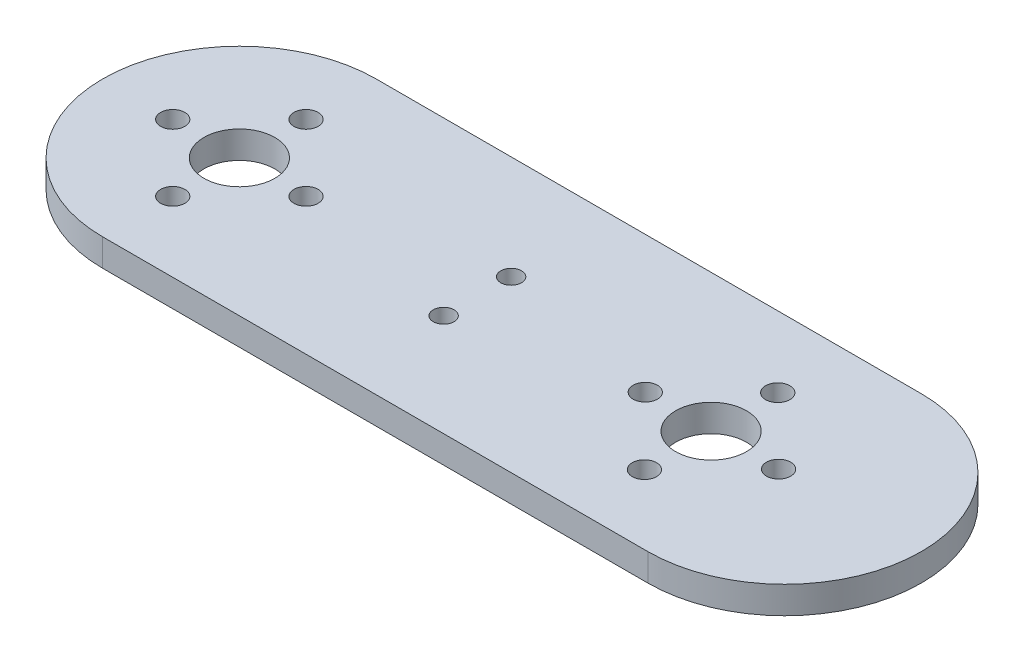
ISO-10303-21;
HEADER;
FILE_DESCRIPTION(('STEP AP214'),'2;1');
FILE_NAME('part.step','',(''),(''),'','','');
FILE_SCHEMA(('AUTOMOTIVE_DESIGN { 1 0 10303 214 1 1 1 1 }'));
ENDSEC;
DATA;
#1=APPLICATION_CONTEXT('core data for automotive mechanical design processes');
#2=APPLICATION_PROTOCOL_DEFINITION('international standard','automotive_design',2000,#1);
#3=PRODUCT_CONTEXT('',#1,'mechanical');
#4=PRODUCT('Part','Part','',(#3));
#5=PRODUCT_RELATED_PRODUCT_CATEGORY('part','',(#4));
#6=PRODUCT_DEFINITION_FORMATION('','',#4);
#7=PRODUCT_DEFINITION_CONTEXT('part definition',#1,'design');
#8=PRODUCT_DEFINITION('design','',#6,#7);
#9=PRODUCT_DEFINITION_SHAPE('','',#8);
#10=(LENGTH_UNIT() NAMED_UNIT(*) SI_UNIT(.MILLI.,.METRE.));
#11=(NAMED_UNIT(*) PLANE_ANGLE_UNIT() SI_UNIT($,.RADIAN.));
#12=(NAMED_UNIT(*) SI_UNIT($,.STERADIAN.) SOLID_ANGLE_UNIT());
#13=UNCERTAINTY_MEASURE_WITH_UNIT(LENGTH_MEASURE(1.E-05),#10,'distance_accuracy_value','');
#14=(GEOMETRIC_REPRESENTATION_CONTEXT(3) GLOBAL_UNCERTAINTY_ASSIGNED_CONTEXT((#13)) GLOBAL_UNIT_ASSIGNED_CONTEXT((#10,
#11,#12)) REPRESENTATION_CONTEXT('',''));
#15=CARTESIAN_POINT('',(0.,0.,0.));
#16=DIRECTION('',(0.,0.,1.));
#17=DIRECTION('',(1.,0.,0.));
#18=AXIS2_PLACEMENT_3D('',#15,#16,#17);
#19=CARTESIAN_POINT('',(0.,-0.54,0.));
#20=DIRECTION('',(0.,1.,0.));
#21=DIRECTION('',(0.,0.,1.));
#22=AXIS2_PLACEMENT_3D('',#19,#20,#21);
#23=CYLINDRICAL_SURFACE('',#22,20.066);
#24=CARTESIAN_POINT('',(0.,3.4625,0.));
#25=DIRECTION('',(0.,-1.,0.));
#26=DIRECTION('',(0.,0.,-1.));
#27=AXIS2_PLACEMENT_3D('',#24,#25,#26);
#28=CIRCLE('',#27,20.066);
#29=CARTESIAN_POINT('',(0.,3.4625,-20.066));
#30=VERTEX_POINT('',#29);
#31=CARTESIAN_POINT('',(0.,3.4625,20.066));
#32=VERTEX_POINT('',#31);
#33=EDGE_CURVE('E60',#30,#32,#28,.F.);
#34=ORIENTED_EDGE('',*,*,#33,.F.);
#35=DIRECTION('',(0.,1.,0.));
#36=VECTOR('',#35,1.);
#37=CARTESIAN_POINT('',(0.,-0.54,-20.066));
#38=LINE('',#37,#36);
#39=CARTESIAN_POINT('',(0.,-0.54,-20.066));
#40=VERTEX_POINT('',#39);
#41=EDGE_CURVE('E113',#40,#30,#38,.T.);
#42=ORIENTED_EDGE('',*,*,#41,.F.);
#43=CARTESIAN_POINT('',(0.,-0.54,0.));
#44=DIRECTION('',(0.,1.,0.));
#45=DIRECTION('',(0.,0.,1.));
#46=AXIS2_PLACEMENT_3D('',#43,#44,#45);
#47=CIRCLE('',#46,20.066);
#48=CARTESIAN_POINT('',(0.,-0.54,20.066));
#49=VERTEX_POINT('',#48);
#50=EDGE_CURVE('E11',#40,#49,#47,.T.);
#51=ORIENTED_EDGE('',*,*,#50,.T.);
#52=DIRECTION('',(0.,1.,0.));
#53=VECTOR('',#52,1.);
#54=CARTESIAN_POINT('',(0.,-0.54,20.066));
#55=LINE('',#54,#53);
#56=EDGE_CURVE('E109',#49,#32,#55,.T.);
#57=ORIENTED_EDGE('',*,*,#56,.T.);
#58=EDGE_LOOP('',(#34,#42,#51,#57));
#59=FACE_BOUND('',#58,.T.);
#60=ADVANCED_FACE('F43',(#59),#23,.T.);
#61=CARTESIAN_POINT('',(0.,-0.54,0.));
#62=DIRECTION('',(0.,1.,0.));
#63=DIRECTION('',(0.,0.,1.));
#64=AXIS2_PLACEMENT_3D('',#61,#62,#63);
#65=PLANE('',#64);
#66=CARTESIAN_POINT('',(69.344,-0.54,-9.655));
#67=DIRECTION('',(0.,1.,0.));
#68=DIRECTION('',(0.,0.,1.));
#69=AXIS2_PLACEMENT_3D('',#66,#67,#68);
#70=CIRCLE('',#69,1.78);
#71=CARTESIAN_POINT('',(69.344,-0.54,-7.875));
#72=VERTEX_POINT('',#71);
#73=EDGE_CURVE('E266',#72,#72,#70,.T.);
#74=ORIENTED_EDGE('',*,*,#73,.T.);
#75=EDGE_LOOP('',(#74));
#76=FACE_BOUND('',#75,.T.);
#77=CARTESIAN_POINT('',(79.124,-0.54,0.));
#78=DIRECTION('',(0.,1.,0.));
#79=DIRECTION('',(0.,0.,1.));
#80=AXIS2_PLACEMENT_3D('',#77,#78,#79);
#81=CIRCLE('',#80,1.78);
#82=CARTESIAN_POINT('',(79.124,-0.54,1.78));
#83=VERTEX_POINT('',#82);
#84=EDGE_CURVE('E269',#83,#83,#81,.T.);
#85=ORIENTED_EDGE('',*,*,#84,.T.);
#86=EDGE_LOOP('',(#85));
#87=FACE_BOUND('',#86,.T.);
#88=CARTESIAN_POINT('',(69.344,-0.54,9.905));
#89=DIRECTION('',(0.,1.,0.));
#90=DIRECTION('',(0.,0.,1.));
#91=AXIS2_PLACEMENT_3D('',#88,#89,#90);
#92=CIRCLE('',#91,1.78);
#93=CARTESIAN_POINT('',(69.344,-0.54,11.685));
#94=VERTEX_POINT('',#93);
#95=EDGE_CURVE('E275',#94,#94,#92,.T.);
#96=ORIENTED_EDGE('',*,*,#95,.T.);
#97=EDGE_LOOP('',(#96));
#98=FACE_BOUND('',#97,.T.);
#99=CARTESIAN_POINT('',(59.564,-0.54,0.));
#100=DIRECTION('',(0.,1.,0.));
#101=DIRECTION('',(0.,0.,1.));
#102=AXIS2_PLACEMENT_3D('',#99,#100,#101);
#103=CIRCLE('',#102,1.78);
#104=CARTESIAN_POINT('',(59.564,-0.54,1.78));
#105=VERTEX_POINT('',#104);
#106=EDGE_CURVE('E281',#105,#105,#103,.T.);
#107=ORIENTED_EDGE('',*,*,#106,.T.);
#108=EDGE_LOOP('',(#107));
#109=FACE_BOUND('',#108,.T.);
#110=CARTESIAN_POINT('',(69.344,-0.54,0.124999999999999));
#111=DIRECTION('',(0.,-1.,0.));
#112=DIRECTION('',(0.,0.,-1.));
#113=AXIS2_PLACEMENT_3D('',#110,#111,#112);
#114=CIRCLE('',#113,5.19999999999999);
#115=CARTESIAN_POINT('',(69.344,-0.54,-5.07499999999999));
#116=VERTEX_POINT('',#115);
#117=EDGE_CURVE('E268',#116,#116,#114,.T.);
#118=ORIENTED_EDGE('',*,*,#117,.F.);
#119=EDGE_LOOP('',(#118));
#120=FACE_BOUND('',#119,.T.);
#121=CARTESIAN_POINT('',(0.,-0.54,0.));
#122=DIRECTION('',(0.,1.,0.));
#123=DIRECTION('',(0.,0.,1.));
#124=AXIS2_PLACEMENT_3D('',#121,#122,#123);
#125=CIRCLE('',#124,5.2);
#126=CARTESIAN_POINT('',(0.,-0.54,5.2));
#127=VERTEX_POINT('',#126);
#128=EDGE_CURVE('E138',#127,#127,#125,.T.);
#129=ORIENTED_EDGE('',*,*,#128,.T.);
#130=EDGE_LOOP('',(#129));
#131=FACE_BOUND('',#130,.T.);
#132=CARTESIAN_POINT('',(35.052,-0.54,-4.826));
#133=DIRECTION('',(0.,-1.,0.));
#134=DIRECTION('',(0.,0.,-1.));
#135=AXIS2_PLACEMENT_3D('',#132,#133,#134);
#136=CIRCLE('',#135,1.524);
#137=CARTESIAN_POINT('',(35.052,-0.54,-6.35));
#138=VERTEX_POINT('',#137);
#139=EDGE_CURVE('E175',#138,#138,#136,.T.);
#140=ORIENTED_EDGE('',*,*,#139,.F.);
#141=EDGE_LOOP('',(#140));
#142=FACE_BOUND('',#141,.T.);
#143=CARTESIAN_POINT('',(35.052,-0.54,5.08));
#144=DIRECTION('',(0.,-1.,0.));
#145=DIRECTION('',(0.,0.,-1.));
#146=AXIS2_PLACEMENT_3D('',#143,#144,#145);
#147=CIRCLE('',#146,1.524);
#148=CARTESIAN_POINT('',(35.052,-0.54,3.556));
#149=VERTEX_POINT('',#148);
#150=EDGE_CURVE('E179',#149,#149,#147,.T.);
#151=ORIENTED_EDGE('',*,*,#150,.F.);
#152=EDGE_LOOP('',(#151));
#153=FACE_BOUND('',#152,.T.);
#154=CARTESIAN_POINT('',(9.779,-0.54,0.));
#155=DIRECTION('',(0.,1.,0.));
#156=DIRECTION('',(-1.,0.,0.));
#157=AXIS2_PLACEMENT_3D('',#154,#155,#156);
#158=CIRCLE('',#157,1.778);
#159=CARTESIAN_POINT('',(8.001,-0.54,0.));
#160=VERTEX_POINT('',#159);
#161=EDGE_CURVE('E122',#160,#160,#158,.T.);
#162=ORIENTED_EDGE('',*,*,#161,.T.);
#163=EDGE_LOOP('',(#162));
#164=FACE_BOUND('',#163,.T.);
#165=CARTESIAN_POINT('',(0.,-0.54,9.779));
#166=DIRECTION('',(0.,1.,0.));
#167=DIRECTION('',(0.,0.,-1.));
#168=AXIS2_PLACEMENT_3D('',#165,#166,#167);
#169=CIRCLE('',#168,1.778);
#170=CARTESIAN_POINT('',(0.,-0.54,8.001));
#171=VERTEX_POINT('',#170);
#172=EDGE_CURVE('E126',#171,#171,#169,.T.);
#173=ORIENTED_EDGE('',*,*,#172,.T.);
#174=EDGE_LOOP('',(#173));
#175=FACE_BOUND('',#174,.T.);
#176=CARTESIAN_POINT('',(-9.779,-0.54,-1.02429588037641E-13));
#177=DIRECTION('',(0.,1.,0.));
#178=DIRECTION('',(1.,0.,0.));
#179=AXIS2_PLACEMENT_3D('',#176,#177,#178);
#180=CIRCLE('',#179,1.778);
#181=CARTESIAN_POINT('',(-8.001,-0.54,0.));
#182=VERTEX_POINT('',#181);
#183=EDGE_CURVE('E121',#182,#182,#180,.T.);
#184=ORIENTED_EDGE('',*,*,#183,.T.);
#185=EDGE_LOOP('',(#184));
#186=FACE_BOUND('',#185,.T.);
#187=CARTESIAN_POINT('',(0.,-0.54,-9.779));
#188=DIRECTION('',(0.,1.,0.));
#189=DIRECTION('',(0.,0.,1.));
#190=AXIS2_PLACEMENT_3D('',#187,#188,#189);
#191=CIRCLE('',#190,1.778);
#192=CARTESIAN_POINT('',(0.,-0.54,-8.001));
#193=VERTEX_POINT('',#192);
#194=EDGE_CURVE('E52',#193,#193,#191,.T.);
#195=ORIENTED_EDGE('',*,*,#194,.T.);
#196=EDGE_LOOP('',(#195));
#197=FACE_BOUND('',#196,.T.);
#198=ORIENTED_EDGE('',*,*,#50,.F.);
#199=DIRECTION('',(1.,0.,0.));
#200=VECTOR('',#199,1.);
#201=CARTESIAN_POINT('',(0.,-0.54,-20.066));
#202=LINE('',#201,#200);
#203=CARTESIAN_POINT('',(80.01,-0.54,-20.066));
#204=VERTEX_POINT('',#203);
#205=EDGE_CURVE('E183',#40,#204,#202,.T.);
#206=ORIENTED_EDGE('',*,*,#205,.T.);
#207=CARTESIAN_POINT('',(80.01,-0.54,0.));
#208=DIRECTION('',(0.,-1.,0.));
#209=DIRECTION('',(0.,0.,-1.));
#210=AXIS2_PLACEMENT_3D('',#207,#208,#209);
#211=CIRCLE('',#210,20.066);
#212=CARTESIAN_POINT('',(80.01,-0.54,20.066));
#213=VERTEX_POINT('',#212);
#214=EDGE_CURVE('E186',#204,#213,#211,.T.);
#215=ORIENTED_EDGE('',*,*,#214,.T.);
#216=DIRECTION('',(1.,0.,0.));
#217=VECTOR('',#216,1.);
#218=CARTESIAN_POINT('',(0.,-0.54,20.066));
#219=LINE('',#218,#217);
#220=EDGE_CURVE('E107',#49,#213,#219,.T.);
#221=ORIENTED_EDGE('',*,*,#220,.F.);
#222=EDGE_LOOP('',(#198,#206,#215,#221));
#223=FACE_BOUND('',#222,.T.);
#224=ADVANCED_FACE('F190',(#76,#87,#98,#109,#120,#131,#142,#153,#164,#175,#186,#197,#223),#65,.F.);
#225=CARTESIAN_POINT('',(0.,-0.54,-9.779));
#226=DIRECTION('',(0.,1.,0.));
#227=DIRECTION('',(0.,0.,1.));
#228=AXIS2_PLACEMENT_3D('',#225,#226,#227);
#229=CYLINDRICAL_SURFACE('',#228,1.778);
#230=CARTESIAN_POINT('',(0.,3.4625,-9.779));
#231=DIRECTION('',(0.,-1.,0.));
#232=DIRECTION('',(0.,0.,-1.));
#233=AXIS2_PLACEMENT_3D('',#230,#231,#232);
#234=CIRCLE('',#233,1.778);
#235=CARTESIAN_POINT('',(0.,3.4625,-11.557));
#236=VERTEX_POINT('',#235);
#237=EDGE_CURVE('E171',#236,#236,#234,.F.);
#238=ORIENTED_EDGE('',*,*,#237,.T.);
#239=EDGE_LOOP('',(#238));
#240=FACE_BOUND('',#239,.T.);
#241=ORIENTED_EDGE('',*,*,#194,.F.);
#242=EDGE_LOOP('',(#241));
#243=FACE_BOUND('',#242,.T.);
#244=ADVANCED_FACE('F198',(#240,#243),#229,.F.);
#245=CARTESIAN_POINT('',(-9.779,-0.54,-1.02429588037641E-13));
#246=DIRECTION('',(0.,1.,0.));
#247=DIRECTION('',(0.,0.,1.));
#248=AXIS2_PLACEMENT_3D('',#245,#246,#247);
#249=CYLINDRICAL_SURFACE('',#248,1.778);
#250=CARTESIAN_POINT('',(-9.779,3.4625,-1.02429588037641E-13));
#251=DIRECTION('',(0.,-1.,0.));
#252=DIRECTION('',(0.,0.,-1.));
#253=AXIS2_PLACEMENT_3D('',#250,#251,#252);
#254=CIRCLE('',#253,1.778);
#255=CARTESIAN_POINT('',(-9.779,3.4625,-1.7780000000001));
#256=VERTEX_POINT('',#255);
#257=EDGE_CURVE('E167',#256,#256,#254,.F.);
#258=ORIENTED_EDGE('',*,*,#257,.T.);
#259=EDGE_LOOP('',(#258));
#260=FACE_BOUND('',#259,.T.);
#261=ORIENTED_EDGE('',*,*,#183,.F.);
#262=EDGE_LOOP('',(#261));
#263=FACE_BOUND('',#262,.T.);
#264=ADVANCED_FACE('F203',(#260,#263),#249,.F.);
#265=CARTESIAN_POINT('',(0.,-0.54,9.779));
#266=DIRECTION('',(0.,1.,0.));
#267=DIRECTION('',(0.,0.,1.));
#268=AXIS2_PLACEMENT_3D('',#265,#266,#267);
#269=CYLINDRICAL_SURFACE('',#268,1.778);
#270=CARTESIAN_POINT('',(0.,3.4625,9.779));
#271=DIRECTION('',(0.,-1.,0.));
#272=DIRECTION('',(0.,0.,-1.));
#273=AXIS2_PLACEMENT_3D('',#270,#271,#272);
#274=CIRCLE('',#273,1.778);
#275=CARTESIAN_POINT('',(0.,3.4625,8.001));
#276=VERTEX_POINT('',#275);
#277=EDGE_CURVE('E163',#276,#276,#274,.F.);
#278=ORIENTED_EDGE('',*,*,#277,.T.);
#279=EDGE_LOOP('',(#278));
#280=FACE_BOUND('',#279,.T.);
#281=ORIENTED_EDGE('',*,*,#172,.F.);
#282=EDGE_LOOP('',(#281));
#283=FACE_BOUND('',#282,.T.);
#284=ADVANCED_FACE('F211',(#280,#283),#269,.F.);
#285=CARTESIAN_POINT('',(9.779,-0.54,0.));
#286=DIRECTION('',(0.,1.,0.));
#287=DIRECTION('',(0.,0.,1.));
#288=AXIS2_PLACEMENT_3D('',#285,#286,#287);
#289=CYLINDRICAL_SURFACE('',#288,1.778);
#290=CARTESIAN_POINT('',(9.779,3.4625,0.));
#291=DIRECTION('',(0.,-1.,0.));
#292=DIRECTION('',(0.,0.,-1.));
#293=AXIS2_PLACEMENT_3D('',#290,#291,#292);
#294=CIRCLE('',#293,1.778);
#295=CARTESIAN_POINT('',(9.779,3.4625,-1.77799999999997));
#296=VERTEX_POINT('',#295);
#297=EDGE_CURVE('E159',#296,#296,#294,.F.);
#298=ORIENTED_EDGE('',*,*,#297,.T.);
#299=EDGE_LOOP('',(#298));
#300=FACE_BOUND('',#299,.T.);
#301=ORIENTED_EDGE('',*,*,#161,.F.);
#302=EDGE_LOOP('',(#301));
#303=FACE_BOUND('',#302,.T.);
#304=ADVANCED_FACE('F215',(#300,#303),#289,.F.);
#305=CARTESIAN_POINT('',(0.,-0.54,-20.066));
#306=DIRECTION('',(0.,0.,1.));
#307=DIRECTION('',(1.,0.,0.));
#308=AXIS2_PLACEMENT_3D('',#305,#306,#307);
#309=PLANE('',#308);
#310=ORIENTED_EDGE('',*,*,#41,.T.);
#311=DIRECTION('',(1.,0.,0.));
#312=VECTOR('',#311,1.);
#313=CARTESIAN_POINT('',(0.,3.4625,-20.066));
#314=LINE('',#313,#312);
#315=CARTESIAN_POINT('',(80.01,3.4625,-20.066));
#316=VERTEX_POINT('',#315);
#317=EDGE_CURVE('E103',#30,#316,#314,.T.);
#318=ORIENTED_EDGE('',*,*,#317,.T.);
#319=DIRECTION('',(0.,1.,0.));
#320=VECTOR('',#319,1.);
#321=CARTESIAN_POINT('',(80.01,-0.54,-20.066));
#322=LINE('',#321,#320);
#323=EDGE_CURVE('E101',#204,#316,#322,.T.);
#324=ORIENTED_EDGE('',*,*,#323,.F.);
#325=ORIENTED_EDGE('',*,*,#205,.F.);
#326=EDGE_LOOP('',(#310,#318,#324,#325));
#327=FACE_BOUND('',#326,.T.);
#328=ADVANCED_FACE('F193',(#327),#309,.F.);
#329=CARTESIAN_POINT('',(80.01,-0.54,0.));
#330=DIRECTION('',(0.,1.,0.));
#331=DIRECTION('',(0.,0.,1.));
#332=AXIS2_PLACEMENT_3D('',#329,#330,#331);
#333=CYLINDRICAL_SURFACE('',#332,20.066);
#334=ORIENTED_EDGE('',*,*,#323,.T.);
#335=CARTESIAN_POINT('',(80.01,3.4625,0.));
#336=DIRECTION('',(0.,-1.,0.));
#337=DIRECTION('',(0.,0.,-1.));
#338=AXIS2_PLACEMENT_3D('',#335,#336,#337);
#339=CIRCLE('',#338,20.066);
#340=CARTESIAN_POINT('',(80.01,3.4625,20.066));
#341=VERTEX_POINT('',#340);
#342=EDGE_CURVE('E86',#316,#341,#339,.T.);
#343=ORIENTED_EDGE('',*,*,#342,.T.);
#344=DIRECTION('',(0.,1.,0.));
#345=VECTOR('',#344,1.);
#346=CARTESIAN_POINT('',(80.01,-0.54,20.066));
#347=LINE('',#346,#345);
#348=EDGE_CURVE('E98',#213,#341,#347,.T.);
#349=ORIENTED_EDGE('',*,*,#348,.F.);
#350=ORIENTED_EDGE('',*,*,#214,.F.);
#351=EDGE_LOOP('',(#334,#343,#349,#350));
#352=FACE_BOUND('',#351,.T.);
#353=ADVANCED_FACE('F96',(#352),#333,.T.);
#354=CARTESIAN_POINT('',(0.,-0.54,20.066));
#355=DIRECTION('',(0.,0.,1.));
#356=DIRECTION('',(1.,0.,0.));
#357=AXIS2_PLACEMENT_3D('',#354,#355,#356);
#358=PLANE('',#357);
#359=DIRECTION('',(1.,0.,0.));
#360=VECTOR('',#359,1.);
#361=CARTESIAN_POINT('',(0.,3.4625,20.066));
#362=LINE('',#361,#360);
#363=EDGE_CURVE('E82',#32,#341,#362,.T.);
#364=ORIENTED_EDGE('',*,*,#363,.F.);
#365=ORIENTED_EDGE('',*,*,#56,.F.);
#366=ORIENTED_EDGE('',*,*,#220,.T.);
#367=ORIENTED_EDGE('',*,*,#348,.T.);
#368=EDGE_LOOP('',(#364,#365,#366,#367));
#369=FACE_BOUND('',#368,.T.);
#370=ADVANCED_FACE('F105',(#369),#358,.T.);
#371=CARTESIAN_POINT('',(35.052,4.2225,5.08));
#372=DIRECTION('',(0.,-1.,0.));
#373=DIRECTION('',(0.,0.,-1.));
#374=AXIS2_PLACEMENT_3D('',#371,#372,#373);
#375=CYLINDRICAL_SURFACE('',#374,1.524);
#376=CARTESIAN_POINT('',(35.052,3.4625,5.08));
#377=DIRECTION('',(0.,-1.,0.));
#378=DIRECTION('',(0.,0.,-1.));
#379=AXIS2_PLACEMENT_3D('',#376,#377,#378);
#380=CIRCLE('',#379,1.524);
#381=CARTESIAN_POINT('',(35.052,3.4625,3.556));
#382=VERTEX_POINT('',#381);
#383=EDGE_CURVE('E91',#382,#382,#380,.F.);
#384=ORIENTED_EDGE('',*,*,#383,.T.);
#385=EDGE_LOOP('',(#384));
#386=FACE_BOUND('',#385,.T.);
#387=ORIENTED_EDGE('',*,*,#150,.T.);
#388=EDGE_LOOP('',(#387));
#389=FACE_BOUND('',#388,.T.);
#390=ADVANCED_FACE('F226',(#386,#389),#375,.F.);
#391=CARTESIAN_POINT('',(35.052,4.2225,-4.826));
#392=DIRECTION('',(0.,-1.,0.));
#393=DIRECTION('',(0.,0.,-1.));
#394=AXIS2_PLACEMENT_3D('',#391,#392,#393);
#395=CYLINDRICAL_SURFACE('',#394,1.524);
#396=CARTESIAN_POINT('',(35.052,3.4625,-4.826));
#397=DIRECTION('',(0.,-1.,0.));
#398=DIRECTION('',(0.,0.,-1.));
#399=AXIS2_PLACEMENT_3D('',#396,#397,#398);
#400=CIRCLE('',#399,1.524);
#401=CARTESIAN_POINT('',(35.052,3.4625,-6.35));
#402=VERTEX_POINT('',#401);
#403=EDGE_CURVE('E135',#402,#402,#400,.F.);
#404=ORIENTED_EDGE('',*,*,#403,.T.);
#405=EDGE_LOOP('',(#404));
#406=FACE_BOUND('',#405,.T.);
#407=ORIENTED_EDGE('',*,*,#139,.T.);
#408=EDGE_LOOP('',(#407));
#409=FACE_BOUND('',#408,.T.);
#410=ADVANCED_FACE('F229',(#406,#409),#395,.F.);
#411=CARTESIAN_POINT('',(0.,3.4625,0.));
#412=DIRECTION('',(0.,-1.,0.));
#413=DIRECTION('',(0.,0.,-1.));
#414=AXIS2_PLACEMENT_3D('',#411,#412,#413);
#415=PLANE('',#414);
#416=CARTESIAN_POINT('',(69.344,3.4625,-9.655));
#417=DIRECTION('',(0.,1.,0.));
#418=DIRECTION('',(0.,0.,1.));
#419=AXIS2_PLACEMENT_3D('',#416,#417,#418);
#420=CIRCLE('',#419,1.78);
#421=CARTESIAN_POINT('',(69.344,3.4625,-7.875));
#422=VERTEX_POINT('',#421);
#423=EDGE_CURVE('E264',#422,#422,#420,.T.);
#424=ORIENTED_EDGE('',*,*,#423,.F.);
#425=EDGE_LOOP('',(#424));
#426=FACE_BOUND('',#425,.T.);
#427=CARTESIAN_POINT('',(79.124,3.4625,0.));
#428=DIRECTION('',(0.,1.,0.));
#429=DIRECTION('',(0.,0.,1.));
#430=AXIS2_PLACEMENT_3D('',#427,#428,#429);
#431=CIRCLE('',#430,1.78);
#432=CARTESIAN_POINT('',(79.124,3.4625,1.78));
#433=VERTEX_POINT('',#432);
#434=EDGE_CURVE('E293',#433,#433,#431,.T.);
#435=ORIENTED_EDGE('',*,*,#434,.F.);
#436=EDGE_LOOP('',(#435));
#437=FACE_BOUND('',#436,.T.);
#438=CARTESIAN_POINT('',(69.344,3.4625,9.905));
#439=DIRECTION('',(0.,1.,0.));
#440=DIRECTION('',(0.,0.,1.));
#441=AXIS2_PLACEMENT_3D('',#438,#439,#440);
#442=CIRCLE('',#441,1.78);
#443=CARTESIAN_POINT('',(69.344,3.4625,11.685));
#444=VERTEX_POINT('',#443);
#445=EDGE_CURVE('E289',#444,#444,#442,.T.);
#446=ORIENTED_EDGE('',*,*,#445,.F.);
#447=EDGE_LOOP('',(#446));
#448=FACE_BOUND('',#447,.T.);
#449=CARTESIAN_POINT('',(59.564,3.4625,0.));
#450=DIRECTION('',(0.,1.,0.));
#451=DIRECTION('',(0.,0.,1.));
#452=AXIS2_PLACEMENT_3D('',#449,#450,#451);
#453=CIRCLE('',#452,1.78);
#454=CARTESIAN_POINT('',(59.564,3.4625,1.78));
#455=VERTEX_POINT('',#454);
#456=EDGE_CURVE('E285',#455,#455,#453,.T.);
#457=ORIENTED_EDGE('',*,*,#456,.F.);
#458=EDGE_LOOP('',(#457));
#459=FACE_BOUND('',#458,.T.);
#460=CARTESIAN_POINT('',(69.344,3.4625,0.124999999999999));
#461=DIRECTION('',(0.,-1.,0.));
#462=DIRECTION('',(0.,0.,-1.));
#463=AXIS2_PLACEMENT_3D('',#460,#461,#462);
#464=CIRCLE('',#463,5.19999999999999);
#465=CARTESIAN_POINT('',(69.344,3.4625,-5.07499999999999));
#466=VERTEX_POINT('',#465);
#467=EDGE_CURVE('E46',#466,#466,#464,.T.);
#468=ORIENTED_EDGE('',*,*,#467,.T.);
#469=EDGE_LOOP('',(#468));
#470=FACE_BOUND('',#469,.T.);
#471=CARTESIAN_POINT('',(0.,3.4625,0.));
#472=DIRECTION('',(0.,-1.,0.));
#473=DIRECTION('',(0.,0.,-1.));
#474=AXIS2_PLACEMENT_3D('',#471,#472,#473);
#475=CIRCLE('',#474,5.2);
#476=CARTESIAN_POINT('',(0.,3.4625,-5.2));
#477=VERTEX_POINT('',#476);
#478=EDGE_CURVE('E146',#477,#477,#475,.T.);
#479=ORIENTED_EDGE('',*,*,#478,.T.);
#480=EDGE_LOOP('',(#479));
#481=FACE_BOUND('',#480,.T.);
#482=ORIENTED_EDGE('',*,*,#257,.F.);
#483=EDGE_LOOP('',(#482));
#484=FACE_BOUND('',#483,.T.);
#485=ORIENTED_EDGE('',*,*,#297,.F.);
#486=EDGE_LOOP('',(#485));
#487=FACE_BOUND('',#486,.T.);
#488=ORIENTED_EDGE('',*,*,#33,.T.);
#489=ORIENTED_EDGE('',*,*,#363,.T.);
#490=ORIENTED_EDGE('',*,*,#342,.F.);
#491=ORIENTED_EDGE('',*,*,#317,.F.);
#492=EDGE_LOOP('',(#488,#489,#490,#491));
#493=FACE_BOUND('',#492,.T.);
#494=ORIENTED_EDGE('',*,*,#403,.F.);
#495=EDGE_LOOP('',(#494));
#496=FACE_BOUND('',#495,.T.);
#497=ORIENTED_EDGE('',*,*,#383,.F.);
#498=EDGE_LOOP('',(#497));
#499=FACE_BOUND('',#498,.T.);
#500=ORIENTED_EDGE('',*,*,#277,.F.);
#501=EDGE_LOOP('',(#500));
#502=FACE_BOUND('',#501,.T.);
#503=ORIENTED_EDGE('',*,*,#237,.F.);
#504=EDGE_LOOP('',(#503));
#505=FACE_BOUND('',#504,.T.);
#506=ADVANCED_FACE('F84',(#426,#437,#448,#459,#470,#481,#484,#487,#493,#496,#499,#502,#505),
#415,.F.);
#507=CARTESIAN_POINT('',(0.,3.4625,0.));
#508=DIRECTION('',(0.,-1.,0.));
#509=DIRECTION('',(0.,0.,-1.));
#510=AXIS2_PLACEMENT_3D('',#507,#508,#509);
#511=CYLINDRICAL_SURFACE('',#510,5.2);
#512=ORIENTED_EDGE('',*,*,#478,.F.);
#513=EDGE_LOOP('',(#512));
#514=FACE_BOUND('',#513,.T.);
#515=ORIENTED_EDGE('',*,*,#128,.F.);
#516=EDGE_LOOP('',(#515));
#517=FACE_BOUND('',#516,.T.);
#518=ADVANCED_FACE('F235',(#514,#517),#511,.F.);
#519=CARTESIAN_POINT('',(69.344,9.46,0.124999999999999));
#520=DIRECTION('',(0.,-1.,0.));
#521=DIRECTION('',(0.,0.,-1.));
#522=AXIS2_PLACEMENT_3D('',#519,#520,#521);
#523=CYLINDRICAL_SURFACE('',#522,5.19999999999999);
#524=ORIENTED_EDGE('',*,*,#117,.T.);
#525=EDGE_LOOP('',(#524));
#526=FACE_BOUND('',#525,.T.);
#527=ORIENTED_EDGE('',*,*,#467,.F.);
#528=EDGE_LOOP('',(#527));
#529=FACE_BOUND('',#528,.T.);
#530=ADVANCED_FACE('F239',(#526,#529),#523,.F.);
#531=CARTESIAN_POINT('',(59.564,-6.5375,0.));
#532=DIRECTION('',(0.,1.,0.));
#533=DIRECTION('',(0.,0.,1.));
#534=AXIS2_PLACEMENT_3D('',#531,#532,#533);
#535=CYLINDRICAL_SURFACE('',#534,1.78);
#536=ORIENTED_EDGE('',*,*,#456,.T.);
#537=EDGE_LOOP('',(#536));
#538=FACE_BOUND('',#537,.T.);
#539=ORIENTED_EDGE('',*,*,#106,.F.);
#540=EDGE_LOOP('',(#539));
#541=FACE_BOUND('',#540,.T.);
#542=ADVANCED_FACE('F243',(#538,#541),#535,.F.);
#543=CARTESIAN_POINT('',(69.344,-6.5375,9.905));
#544=DIRECTION('',(0.,1.,0.));
#545=DIRECTION('',(0.,0.,1.));
#546=AXIS2_PLACEMENT_3D('',#543,#544,#545);
#547=CYLINDRICAL_SURFACE('',#546,1.78);
#548=ORIENTED_EDGE('',*,*,#445,.T.);
#549=EDGE_LOOP('',(#548));
#550=FACE_BOUND('',#549,.T.);
#551=ORIENTED_EDGE('',*,*,#95,.F.);
#552=EDGE_LOOP('',(#551));
#553=FACE_BOUND('',#552,.T.);
#554=ADVANCED_FACE('F247',(#550,#553),#547,.F.);
#555=CARTESIAN_POINT('',(79.124,-6.5375,0.));
#556=DIRECTION('',(0.,1.,0.));
#557=DIRECTION('',(0.,0.,1.));
#558=AXIS2_PLACEMENT_3D('',#555,#556,#557);
#559=CYLINDRICAL_SURFACE('',#558,1.78);
#560=ORIENTED_EDGE('',*,*,#434,.T.);
#561=EDGE_LOOP('',(#560));
#562=FACE_BOUND('',#561,.T.);
#563=ORIENTED_EDGE('',*,*,#84,.F.);
#564=EDGE_LOOP('',(#563));
#565=FACE_BOUND('',#564,.T.);
#566=ADVANCED_FACE('F251',(#562,#565),#559,.F.);
#567=CARTESIAN_POINT('',(69.344,-6.5375,-9.655));
#568=DIRECTION('',(0.,1.,0.));
#569=DIRECTION('',(0.,0.,1.));
#570=AXIS2_PLACEMENT_3D('',#567,#568,#569);
#571=CYLINDRICAL_SURFACE('',#570,1.78);
#572=ORIENTED_EDGE('',*,*,#423,.T.);
#573=EDGE_LOOP('',(#572));
#574=FACE_BOUND('',#573,.T.);
#575=ORIENTED_EDGE('',*,*,#73,.F.);
#576=EDGE_LOOP('',(#575));
#577=FACE_BOUND('',#576,.T.);
#578=ADVANCED_FACE('F255',(#574,#577),#571,.F.);
#579=CLOSED_SHELL('',(#60,#224,#244,#264,#284,#304,#328,#353,#370,#390,#410,#506,#518,#530,#542,
#554,#566,#578));
#580=MANIFOLD_SOLID_BREP('B2',#579);
#581=ADVANCED_BREP_SHAPE_REPRESENTATION('',(#18,#580),#14);
#582=SHAPE_DEFINITION_REPRESENTATION(#9,#581);
ENDSEC;
END-ISO-10303-21;
